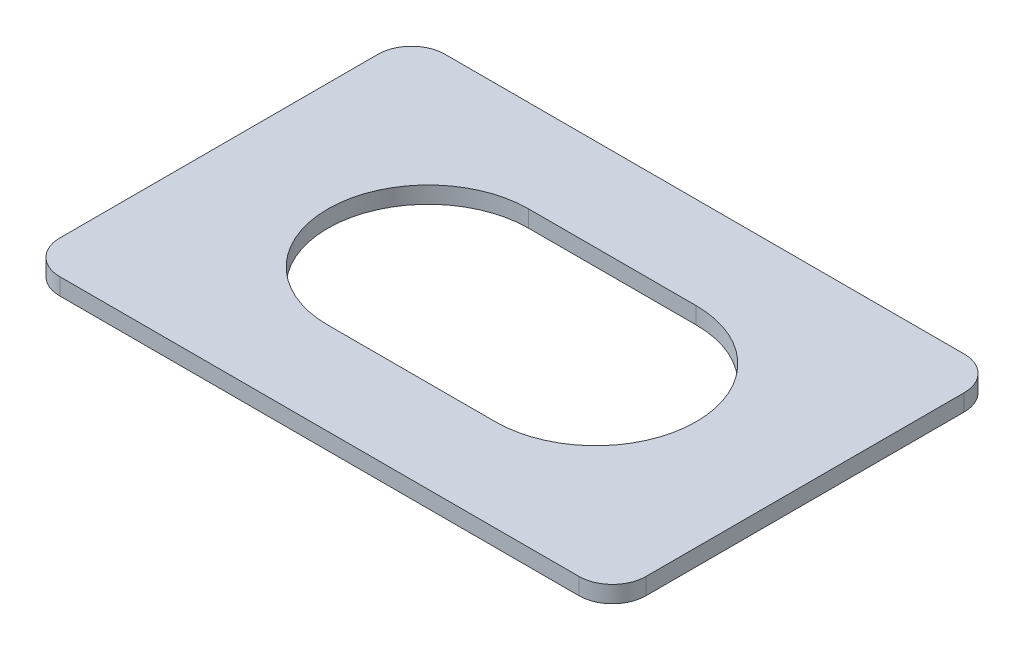
ISO-10303-21;
HEADER;
FILE_DESCRIPTION(('STEP AP214'),'2;1');
FILE_NAME('part.step','',(''),(''),'','','');
FILE_SCHEMA(('AUTOMOTIVE_DESIGN { 1 0 10303 214 1 1 1 1 }'));
ENDSEC;
DATA;
#1=APPLICATION_CONTEXT('core data for automotive mechanical design processes');
#2=APPLICATION_PROTOCOL_DEFINITION('international standard','automotive_design',2000,#1);
#3=PRODUCT_CONTEXT('',#1,'mechanical');
#4=PRODUCT('Part','Part','',(#3));
#5=PRODUCT_RELATED_PRODUCT_CATEGORY('part','',(#4));
#6=PRODUCT_DEFINITION_FORMATION('','',#4);
#7=PRODUCT_DEFINITION_CONTEXT('part definition',#1,'design');
#8=PRODUCT_DEFINITION('design','',#6,#7);
#9=PRODUCT_DEFINITION_SHAPE('','',#8);
#10=(LENGTH_UNIT() NAMED_UNIT(*) SI_UNIT(.MILLI.,.METRE.));
#11=(NAMED_UNIT(*) PLANE_ANGLE_UNIT() SI_UNIT($,.RADIAN.));
#12=(NAMED_UNIT(*) SI_UNIT($,.STERADIAN.) SOLID_ANGLE_UNIT());
#13=UNCERTAINTY_MEASURE_WITH_UNIT(LENGTH_MEASURE(1.E-05),#10,'distance_accuracy_value','');
#14=(GEOMETRIC_REPRESENTATION_CONTEXT(3) GLOBAL_UNCERTAINTY_ASSIGNED_CONTEXT((#13)) GLOBAL_UNIT_ASSIGNED_CONTEXT((#10,
#11,#12)) REPRESENTATION_CONTEXT('',''));
#15=CARTESIAN_POINT('',(0.,0.,0.));
#16=DIRECTION('',(0.,0.,1.));
#17=DIRECTION('',(1.,0.,0.));
#18=AXIS2_PLACEMENT_3D('',#15,#16,#17);
#19=CARTESIAN_POINT('',(15.5,1.,9.50000000000001));
#20=DIRECTION('',(0.,1.,0.));
#21=DIRECTION('',(0.,0.,1.));
#22=AXIS2_PLACEMENT_3D('',#19,#20,#21);
#23=PLANE('',#22);
#24=CARTESIAN_POINT('',(15.5,1.,9.50000000000001));
#25=DIRECTION('',(0.,1.,0.));
#26=DIRECTION('',(0.,0.,1.));
#27=AXIS2_PLACEMENT_3D('',#24,#25,#26);
#28=CIRCLE('',#27,2.);
#29=CARTESIAN_POINT('',(15.5,1.,11.5));
#30=VERTEX_POINT('',#29);
#31=CARTESIAN_POINT('',(17.5,1.,9.50000000000001));
#32=VERTEX_POINT('',#31);
#33=EDGE_CURVE('E157',#30,#32,#28,.T.);
#34=ORIENTED_EDGE('',*,*,#33,.T.);
#35=DIRECTION('',(0.,0.,-1.));
#36=VECTOR('',#35,1.);
#37=CARTESIAN_POINT('',(17.5,1.,9.50000000000001));
#38=LINE('',#37,#36);
#39=CARTESIAN_POINT('',(17.5,1.,-9.49999999999998));
#40=VERTEX_POINT('',#39);
#41=EDGE_CURVE('E160',#32,#40,#38,.T.);
#42=ORIENTED_EDGE('',*,*,#41,.T.);
#43=CARTESIAN_POINT('',(15.5,1.,-9.49999999999999));
#44=DIRECTION('',(0.,1.,0.));
#45=DIRECTION('',(0.,0.,1.));
#46=AXIS2_PLACEMENT_3D('',#43,#44,#45);
#47=CIRCLE('',#46,2.);
#48=CARTESIAN_POINT('',(15.5,1.,-11.5));
#49=VERTEX_POINT('',#48);
#50=EDGE_CURVE('E163',#40,#49,#47,.T.);
#51=ORIENTED_EDGE('',*,*,#50,.T.);
#52=DIRECTION('',(-1.,0.,0.));
#53=VECTOR('',#52,1.);
#54=CARTESIAN_POINT('',(15.5,1.,-11.5));
#55=LINE('',#54,#53);
#56=CARTESIAN_POINT('',(-15.5,1.,-11.5));
#57=VERTEX_POINT('',#56);
#58=EDGE_CURVE('E165',#49,#57,#55,.T.);
#59=ORIENTED_EDGE('',*,*,#58,.T.);
#60=CARTESIAN_POINT('',(-15.5,1.,-9.49999999999999));
#61=DIRECTION('',(0.,1.,0.));
#62=DIRECTION('',(0.,0.,1.));
#63=AXIS2_PLACEMENT_3D('',#60,#61,#62);
#64=CIRCLE('',#63,2.);
#65=CARTESIAN_POINT('',(-17.5,1.,-9.49999999999998));
#66=VERTEX_POINT('',#65);
#67=EDGE_CURVE('E167',#57,#66,#64,.T.);
#68=ORIENTED_EDGE('',*,*,#67,.T.);
#69=DIRECTION('',(0.,0.,1.));
#70=VECTOR('',#69,1.);
#71=CARTESIAN_POINT('',(-17.5,1.,9.50000000000001));
#72=LINE('',#71,#70);
#73=CARTESIAN_POINT('',(-17.5,1.,9.50000000000001));
#74=VERTEX_POINT('',#73);
#75=EDGE_CURVE('E169',#66,#74,#72,.T.);
#76=ORIENTED_EDGE('',*,*,#75,.T.);
#77=CARTESIAN_POINT('',(-15.5,1.,9.50000000000001));
#78=DIRECTION('',(0.,1.,0.));
#79=DIRECTION('',(0.,0.,-1.));
#80=AXIS2_PLACEMENT_3D('',#77,#78,#79);
#81=CIRCLE('',#80,2.);
#82=CARTESIAN_POINT('',(-15.5,1.,11.5));
#83=VERTEX_POINT('',#82);
#84=EDGE_CURVE('E171',#74,#83,#81,.T.);
#85=ORIENTED_EDGE('',*,*,#84,.T.);
#86=DIRECTION('',(1.,0.,0.));
#87=VECTOR('',#86,1.);
#88=CARTESIAN_POINT('',(15.5,1.,11.5));
#89=LINE('',#88,#87);
#90=EDGE_CURVE('E173',#83,#30,#89,.T.);
#91=ORIENTED_EDGE('',*,*,#90,.T.);
#92=EDGE_LOOP('',(#34,#42,#51,#59,#68,#76,#85,#91));
#93=FACE_BOUND('',#92,.T.);
#94=DIRECTION('',(1.,0.,0.));
#95=VECTOR('',#94,1.);
#96=CARTESIAN_POINT('',(5.,1.,6.00000000000002));
#97=LINE('',#96,#95);
#98=CARTESIAN_POINT('',(-5.,1.,6.00000000000002));
#99=VERTEX_POINT('',#98);
#100=CARTESIAN_POINT('',(5.,1.,6.00000000000002));
#101=VERTEX_POINT('',#100);
#102=EDGE_CURVE('E129',#99,#101,#97,.T.);
#103=ORIENTED_EDGE('',*,*,#102,.F.);
#104=CARTESIAN_POINT('',(-5.,1.,0.));
#105=DIRECTION('',(0.,1.,0.));
#106=DIRECTION('',(0.,0.,1.));
#107=AXIS2_PLACEMENT_3D('',#104,#105,#106);
#108=CIRCLE('',#107,6.);
#109=CARTESIAN_POINT('',(-5.,1.,-5.99999999999998));
#110=VERTEX_POINT('',#109);
#111=EDGE_CURVE('E121',#110,#99,#108,.T.);
#112=ORIENTED_EDGE('',*,*,#111,.F.);
#113=DIRECTION('',(-1.,0.,0.));
#114=VECTOR('',#113,1.);
#115=CARTESIAN_POINT('',(-5.,1.,-5.99999999999998));
#116=LINE('',#115,#114);
#117=CARTESIAN_POINT('',(5.,1.,-5.99999999999998));
#118=VERTEX_POINT('',#117);
#119=EDGE_CURVE('E143',#118,#110,#116,.T.);
#120=ORIENTED_EDGE('',*,*,#119,.F.);
#121=CARTESIAN_POINT('',(5.,1.,0.));
#122=DIRECTION('',(0.,1.,0.));
#123=DIRECTION('',(0.,0.,-1.));
#124=AXIS2_PLACEMENT_3D('',#121,#122,#123);
#125=CIRCLE('',#124,6.);
#126=EDGE_CURVE('E141',#101,#118,#125,.T.);
#127=ORIENTED_EDGE('',*,*,#126,.F.);
#128=EDGE_LOOP('',(#103,#112,#120,#127));
#129=FACE_BOUND('',#128,.T.);
#130=ADVANCED_FACE('F32',(#93,#129),#23,.T.);
#131=CARTESIAN_POINT('',(15.5,0.,9.50000000000001));
#132=DIRECTION('',(0.,1.,0.));
#133=DIRECTION('',(0.,0.,1.));
#134=AXIS2_PLACEMENT_3D('',#131,#132,#133);
#135=PLANE('',#134);
#136=CARTESIAN_POINT('',(15.5,0.,9.50000000000001));
#137=DIRECTION('',(0.,1.,0.));
#138=DIRECTION('',(0.,0.,1.));
#139=AXIS2_PLACEMENT_3D('',#136,#137,#138);
#140=CIRCLE('',#139,2.);
#141=CARTESIAN_POINT('',(15.5,0.,11.5));
#142=VERTEX_POINT('',#141);
#143=CARTESIAN_POINT('',(17.5,0.,9.50000000000001));
#144=VERTEX_POINT('',#143);
#145=EDGE_CURVE('E137',#142,#144,#140,.T.);
#146=ORIENTED_EDGE('',*,*,#145,.F.);
#147=DIRECTION('',(1.,0.,0.));
#148=VECTOR('',#147,1.);
#149=CARTESIAN_POINT('',(15.5,0.,11.5));
#150=LINE('',#149,#148);
#151=CARTESIAN_POINT('',(-15.5,0.,11.5));
#152=VERTEX_POINT('',#151);
#153=EDGE_CURVE('E161',#152,#142,#150,.T.);
#154=ORIENTED_EDGE('',*,*,#153,.F.);
#155=CARTESIAN_POINT('',(-15.5,0.,9.50000000000001));
#156=DIRECTION('',(0.,1.,0.));
#157=DIRECTION('',(0.,0.,-1.));
#158=AXIS2_PLACEMENT_3D('',#155,#156,#157);
#159=CIRCLE('',#158,2.);
#160=CARTESIAN_POINT('',(-17.5,0.,9.50000000000001));
#161=VERTEX_POINT('',#160);
#162=EDGE_CURVE('E188',#161,#152,#159,.T.);
#163=ORIENTED_EDGE('',*,*,#162,.F.);
#164=DIRECTION('',(0.,0.,1.));
#165=VECTOR('',#164,1.);
#166=CARTESIAN_POINT('',(-17.5,0.,9.50000000000001));
#167=LINE('',#166,#165);
#168=CARTESIAN_POINT('',(-17.5,0.,-9.49999999999998));
#169=VERTEX_POINT('',#168);
#170=EDGE_CURVE('E186',#169,#161,#167,.T.);
#171=ORIENTED_EDGE('',*,*,#170,.F.);
#172=CARTESIAN_POINT('',(-15.5,0.,-9.49999999999999));
#173=DIRECTION('',(0.,1.,0.));
#174=DIRECTION('',(0.,0.,1.));
#175=AXIS2_PLACEMENT_3D('',#172,#173,#174);
#176=CIRCLE('',#175,2.);
#177=CARTESIAN_POINT('',(-15.5,0.,-11.5));
#178=VERTEX_POINT('',#177);
#179=EDGE_CURVE('E184',#178,#169,#176,.T.);
#180=ORIENTED_EDGE('',*,*,#179,.F.);
#181=DIRECTION('',(-1.,0.,0.));
#182=VECTOR('',#181,1.);
#183=CARTESIAN_POINT('',(15.5,0.,-11.5));
#184=LINE('',#183,#182);
#185=CARTESIAN_POINT('',(15.5,0.,-11.5));
#186=VERTEX_POINT('',#185);
#187=EDGE_CURVE('E182',#186,#178,#184,.T.);
#188=ORIENTED_EDGE('',*,*,#187,.F.);
#189=CARTESIAN_POINT('',(15.5,0.,-9.49999999999999));
#190=DIRECTION('',(0.,1.,0.));
#191=DIRECTION('',(0.,0.,1.));
#192=AXIS2_PLACEMENT_3D('',#189,#190,#191);
#193=CIRCLE('',#192,2.);
#194=CARTESIAN_POINT('',(17.5,0.,-9.49999999999998));
#195=VERTEX_POINT('',#194);
#196=EDGE_CURVE('E180',#195,#186,#193,.T.);
#197=ORIENTED_EDGE('',*,*,#196,.F.);
#198=DIRECTION('',(0.,0.,-1.));
#199=VECTOR('',#198,1.);
#200=CARTESIAN_POINT('',(17.5,0.,9.50000000000001));
#201=LINE('',#200,#199);
#202=EDGE_CURVE('E178',#144,#195,#201,.T.);
#203=ORIENTED_EDGE('',*,*,#202,.F.);
#204=EDGE_LOOP('',(#146,#154,#163,#171,#180,#188,#197,#203));
#205=FACE_BOUND('',#204,.T.);
#206=CARTESIAN_POINT('',(-5.,0.,0.));
#207=DIRECTION('',(0.,1.,0.));
#208=DIRECTION('',(0.,0.,1.));
#209=AXIS2_PLACEMENT_3D('',#206,#207,#208);
#210=CIRCLE('',#209,6.);
#211=CARTESIAN_POINT('',(-5.,0.,-5.99999999999998));
#212=VERTEX_POINT('',#211);
#213=CARTESIAN_POINT('',(-5.,0.,6.00000000000002));
#214=VERTEX_POINT('',#213);
#215=EDGE_CURVE('E55',#212,#214,#210,.T.);
#216=ORIENTED_EDGE('',*,*,#215,.T.);
#217=DIRECTION('',(1.,0.,0.));
#218=VECTOR('',#217,1.);
#219=CARTESIAN_POINT('',(5.,0.,6.00000000000002));
#220=LINE('',#219,#218);
#221=CARTESIAN_POINT('',(5.,0.,6.00000000000002));
#222=VERTEX_POINT('',#221);
#223=EDGE_CURVE('E136',#214,#222,#220,.T.);
#224=ORIENTED_EDGE('',*,*,#223,.T.);
#225=CARTESIAN_POINT('',(5.,0.,0.));
#226=DIRECTION('',(0.,1.,0.));
#227=DIRECTION('',(0.,0.,-1.));
#228=AXIS2_PLACEMENT_3D('',#225,#226,#227);
#229=CIRCLE('',#228,6.);
#230=CARTESIAN_POINT('',(5.,0.,-5.99999999999998));
#231=VERTEX_POINT('',#230);
#232=EDGE_CURVE('E149',#222,#231,#229,.T.);
#233=ORIENTED_EDGE('',*,*,#232,.T.);
#234=DIRECTION('',(-1.,0.,0.));
#235=VECTOR('',#234,1.);
#236=CARTESIAN_POINT('',(-5.,0.,-5.99999999999998));
#237=LINE('',#236,#235);
#238=EDGE_CURVE('E130',#231,#212,#237,.T.);
#239=ORIENTED_EDGE('',*,*,#238,.T.);
#240=EDGE_LOOP('',(#216,#224,#233,#239));
#241=FACE_BOUND('',#240,.T.);
#242=ADVANCED_FACE('F218',(#205,#241),#135,.F.);
#243=CARTESIAN_POINT('',(15.5,1.,9.50000000000001));
#244=DIRECTION('',(0.,-1.,0.));
#245=DIRECTION('',(0.,0.,-1.));
#246=AXIS2_PLACEMENT_3D('',#243,#244,#245);
#247=CYLINDRICAL_SURFACE('',#246,2.);
#248=ORIENTED_EDGE('',*,*,#145,.T.);
#249=DIRECTION('',(0.,-1.,0.));
#250=VECTOR('',#249,1.);
#251=CARTESIAN_POINT('',(17.5,1.,9.50000000000001));
#252=LINE('',#251,#250);
#253=EDGE_CURVE('E11',#32,#144,#252,.T.);
#254=ORIENTED_EDGE('',*,*,#253,.F.);
#255=ORIENTED_EDGE('',*,*,#33,.F.);
#256=DIRECTION('',(0.,-1.,0.));
#257=VECTOR('',#256,1.);
#258=CARTESIAN_POINT('',(15.5,1.,11.5));
#259=LINE('',#258,#257);
#260=EDGE_CURVE('E175',#30,#142,#259,.T.);
#261=ORIENTED_EDGE('',*,*,#260,.T.);
#262=EDGE_LOOP('',(#248,#254,#255,#261));
#263=FACE_BOUND('',#262,.T.);
#264=ADVANCED_FACE('F34',(#263),#247,.T.);
#265=CARTESIAN_POINT('',(17.5,1.,9.50000000000001));
#266=DIRECTION('',(-1.,0.,0.));
#267=DIRECTION('',(0.,0.,1.));
#268=AXIS2_PLACEMENT_3D('',#265,#266,#267);
#269=PLANE('',#268);
#270=ORIENTED_EDGE('',*,*,#202,.T.);
#271=DIRECTION('',(0.,-1.,0.));
#272=VECTOR('',#271,1.);
#273=CARTESIAN_POINT('',(17.5,1.,-9.49999999999998));
#274=LINE('',#273,#272);
#275=EDGE_CURVE('E40',#40,#195,#274,.T.);
#276=ORIENTED_EDGE('',*,*,#275,.F.);
#277=ORIENTED_EDGE('',*,*,#41,.F.);
#278=ORIENTED_EDGE('',*,*,#253,.T.);
#279=EDGE_LOOP('',(#270,#276,#277,#278));
#280=FACE_BOUND('',#279,.T.);
#281=ADVANCED_FACE('F235',(#280),#269,.F.);
#282=CARTESIAN_POINT('',(15.5,1.,-9.49999999999999));
#283=DIRECTION('',(0.,-1.,0.));
#284=DIRECTION('',(0.,0.,-1.));
#285=AXIS2_PLACEMENT_3D('',#282,#283,#284);
#286=CYLINDRICAL_SURFACE('',#285,2.);
#287=ORIENTED_EDGE('',*,*,#196,.T.);
#288=DIRECTION('',(0.,-1.,0.));
#289=VECTOR('',#288,1.);
#290=CARTESIAN_POINT('',(15.5,1.,-11.5));
#291=LINE('',#290,#289);
#292=EDGE_CURVE('E205',#49,#186,#291,.T.);
#293=ORIENTED_EDGE('',*,*,#292,.F.);
#294=ORIENTED_EDGE('',*,*,#50,.F.);
#295=ORIENTED_EDGE('',*,*,#275,.T.);
#296=EDGE_LOOP('',(#287,#293,#294,#295));
#297=FACE_BOUND('',#296,.T.);
#298=ADVANCED_FACE('F212',(#297),#286,.T.);
#299=CARTESIAN_POINT('',(15.5,1.,-11.5));
#300=DIRECTION('',(0.,0.,1.));
#301=DIRECTION('',(1.,0.,0.));
#302=AXIS2_PLACEMENT_3D('',#299,#300,#301);
#303=PLANE('',#302);
#304=ORIENTED_EDGE('',*,*,#187,.T.);
#305=DIRECTION('',(0.,-1.,0.));
#306=VECTOR('',#305,1.);
#307=CARTESIAN_POINT('',(-15.5,1.,-11.5));
#308=LINE('',#307,#306);
#309=EDGE_CURVE('E202',#57,#178,#308,.T.);
#310=ORIENTED_EDGE('',*,*,#309,.F.);
#311=ORIENTED_EDGE('',*,*,#58,.F.);
#312=ORIENTED_EDGE('',*,*,#292,.T.);
#313=EDGE_LOOP('',(#304,#310,#311,#312));
#314=FACE_BOUND('',#313,.T.);
#315=ADVANCED_FACE('F224',(#314),#303,.F.);
#316=CARTESIAN_POINT('',(-15.5,1.,-9.49999999999999));
#317=DIRECTION('',(0.,-1.,0.));
#318=DIRECTION('',(0.,0.,-1.));
#319=AXIS2_PLACEMENT_3D('',#316,#317,#318);
#320=CYLINDRICAL_SURFACE('',#319,2.);
#321=ORIENTED_EDGE('',*,*,#179,.T.);
#322=DIRECTION('',(0.,-1.,0.));
#323=VECTOR('',#322,1.);
#324=CARTESIAN_POINT('',(-17.5,1.,-9.49999999999998));
#325=LINE('',#324,#323);
#326=EDGE_CURVE('E199',#66,#169,#325,.T.);
#327=ORIENTED_EDGE('',*,*,#326,.F.);
#328=ORIENTED_EDGE('',*,*,#67,.F.);
#329=ORIENTED_EDGE('',*,*,#309,.T.);
#330=EDGE_LOOP('',(#321,#327,#328,#329));
#331=FACE_BOUND('',#330,.T.);
#332=ADVANCED_FACE('F228',(#331),#320,.T.);
#333=CARTESIAN_POINT('',(-17.5,1.,9.50000000000001));
#334=DIRECTION('',(1.,0.,0.));
#335=DIRECTION('',(0.,0.,-1.));
#336=AXIS2_PLACEMENT_3D('',#333,#334,#335);
#337=PLANE('',#336);
#338=ORIENTED_EDGE('',*,*,#170,.T.);
#339=DIRECTION('',(0.,-1.,0.));
#340=VECTOR('',#339,1.);
#341=CARTESIAN_POINT('',(-17.5,1.,9.50000000000001));
#342=LINE('',#341,#340);
#343=EDGE_CURVE('E196',#74,#161,#342,.T.);
#344=ORIENTED_EDGE('',*,*,#343,.F.);
#345=ORIENTED_EDGE('',*,*,#75,.F.);
#346=ORIENTED_EDGE('',*,*,#326,.T.);
#347=EDGE_LOOP('',(#338,#344,#345,#346));
#348=FACE_BOUND('',#347,.T.);
#349=ADVANCED_FACE('F248',(#348),#337,.F.);
#350=CARTESIAN_POINT('',(-15.5,1.,9.50000000000001));
#351=DIRECTION('',(0.,-1.,0.));
#352=DIRECTION('',(0.,0.,-1.));
#353=AXIS2_PLACEMENT_3D('',#350,#351,#352);
#354=CYLINDRICAL_SURFACE('',#353,2.);
#355=ORIENTED_EDGE('',*,*,#162,.T.);
#356=DIRECTION('',(0.,-1.,0.));
#357=VECTOR('',#356,1.);
#358=CARTESIAN_POINT('',(-15.5,1.,11.5));
#359=LINE('',#358,#357);
#360=EDGE_CURVE('E193',#83,#152,#359,.T.);
#361=ORIENTED_EDGE('',*,*,#360,.F.);
#362=ORIENTED_EDGE('',*,*,#84,.F.);
#363=ORIENTED_EDGE('',*,*,#343,.T.);
#364=EDGE_LOOP('',(#355,#361,#362,#363));
#365=FACE_BOUND('',#364,.T.);
#366=ADVANCED_FACE('F246',(#365),#354,.T.);
#367=CARTESIAN_POINT('',(15.5,1.,11.5));
#368=DIRECTION('',(0.,0.,-1.));
#369=DIRECTION('',(-1.,0.,0.));
#370=AXIS2_PLACEMENT_3D('',#367,#368,#369);
#371=PLANE('',#370);
#372=ORIENTED_EDGE('',*,*,#153,.T.);
#373=ORIENTED_EDGE('',*,*,#260,.F.);
#374=ORIENTED_EDGE('',*,*,#90,.F.);
#375=ORIENTED_EDGE('',*,*,#360,.T.);
#376=EDGE_LOOP('',(#372,#373,#374,#375));
#377=FACE_BOUND('',#376,.T.);
#378=ADVANCED_FACE('F241',(#377),#371,.F.);
#379=CARTESIAN_POINT('',(-5.,1.,0.));
#380=DIRECTION('',(0.,-1.,0.));
#381=DIRECTION('',(0.,0.,-1.));
#382=AXIS2_PLACEMENT_3D('',#379,#380,#381);
#383=CYLINDRICAL_SURFACE('',#382,6.);
#384=ORIENTED_EDGE('',*,*,#215,.F.);
#385=DIRECTION('',(0.,-1.,0.));
#386=VECTOR('',#385,1.);
#387=CARTESIAN_POINT('',(-5.,1.,-5.99999999999998));
#388=LINE('',#387,#386);
#389=EDGE_CURVE('E125',#110,#212,#388,.T.);
#390=ORIENTED_EDGE('',*,*,#389,.F.);
#391=ORIENTED_EDGE('',*,*,#111,.T.);
#392=DIRECTION('',(0.,-1.,0.));
#393=VECTOR('',#392,1.);
#394=CARTESIAN_POINT('',(-5.,1.,6.00000000000002));
#395=LINE('',#394,#393);
#396=EDGE_CURVE('E124',#99,#214,#395,.T.);
#397=ORIENTED_EDGE('',*,*,#396,.T.);
#398=EDGE_LOOP('',(#384,#390,#391,#397));
#399=FACE_BOUND('',#398,.T.);
#400=ADVANCED_FACE('F123',(#399),#383,.F.);
#401=CARTESIAN_POINT('',(5.,1.,6.00000000000002));
#402=DIRECTION('',(0.,0.,-1.));
#403=DIRECTION('',(-1.,0.,0.));
#404=AXIS2_PLACEMENT_3D('',#401,#402,#403);
#405=PLANE('',#404);
#406=ORIENTED_EDGE('',*,*,#223,.F.);
#407=ORIENTED_EDGE('',*,*,#396,.F.);
#408=ORIENTED_EDGE('',*,*,#102,.T.);
#409=DIRECTION('',(0.,-1.,0.));
#410=VECTOR('',#409,1.);
#411=CARTESIAN_POINT('',(5.,1.,6.00000000000002));
#412=LINE('',#411,#410);
#413=EDGE_CURVE('E138',#101,#222,#412,.T.);
#414=ORIENTED_EDGE('',*,*,#413,.T.);
#415=EDGE_LOOP('',(#406,#407,#408,#414));
#416=FACE_BOUND('',#415,.T.);
#417=ADVANCED_FACE('F133',(#416),#405,.T.);
#418=CARTESIAN_POINT('',(5.,1.,0.));
#419=DIRECTION('',(0.,-1.,0.));
#420=DIRECTION('',(0.,0.,-1.));
#421=AXIS2_PLACEMENT_3D('',#418,#419,#420);
#422=CYLINDRICAL_SURFACE('',#421,6.);
#423=ORIENTED_EDGE('',*,*,#232,.F.);
#424=ORIENTED_EDGE('',*,*,#413,.F.);
#425=ORIENTED_EDGE('',*,*,#126,.T.);
#426=DIRECTION('',(0.,-1.,0.));
#427=VECTOR('',#426,1.);
#428=CARTESIAN_POINT('',(5.,1.,-5.99999999999998));
#429=LINE('',#428,#427);
#430=EDGE_CURVE('E47',#118,#231,#429,.T.);
#431=ORIENTED_EDGE('',*,*,#430,.T.);
#432=EDGE_LOOP('',(#423,#424,#425,#431));
#433=FACE_BOUND('',#432,.T.);
#434=ADVANCED_FACE('F273',(#433),#422,.F.);
#435=CARTESIAN_POINT('',(-5.,1.,-5.99999999999998));
#436=DIRECTION('',(0.,0.,1.));
#437=DIRECTION('',(1.,0.,0.));
#438=AXIS2_PLACEMENT_3D('',#435,#436,#437);
#439=PLANE('',#438);
#440=ORIENTED_EDGE('',*,*,#238,.F.);
#441=ORIENTED_EDGE('',*,*,#430,.F.);
#442=ORIENTED_EDGE('',*,*,#119,.T.);
#443=ORIENTED_EDGE('',*,*,#389,.T.);
#444=EDGE_LOOP('',(#440,#441,#442,#443));
#445=FACE_BOUND('',#444,.T.);
#446=ADVANCED_FACE('F277',(#445),#439,.T.);
#447=CLOSED_SHELL('',(#130,#242,#264,#281,#298,#315,#332,#349,#366,#378,#400,#417,#434,#446));
#448=MANIFOLD_SOLID_BREP('B2',#447);
#449=ADVANCED_BREP_SHAPE_REPRESENTATION('',(#18,#448),#14);
#450=SHAPE_DEFINITION_REPRESENTATION(#9,#449);
ENDSEC;
END-ISO-10303-21;
